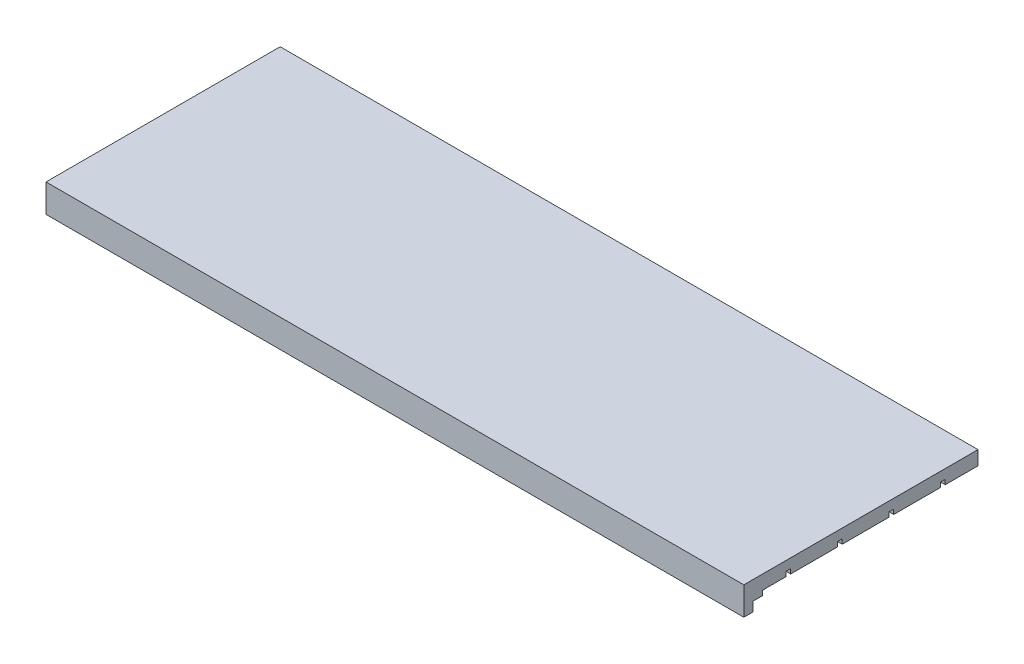
ISO-10303-21;
HEADER;
FILE_DESCRIPTION(('STEP AP214'),'2;1');
FILE_NAME('part.step','',(''),(''),'','','');
FILE_SCHEMA(('AUTOMOTIVE_DESIGN { 1 0 10303 214 1 1 1 1 }'));
ENDSEC;
DATA;
#1=APPLICATION_CONTEXT('core data for automotive mechanical design processes');
#2=APPLICATION_PROTOCOL_DEFINITION('international standard','automotive_design',2000,#1);
#3=PRODUCT_CONTEXT('',#1,'mechanical');
#4=PRODUCT('Part','Part','',(#3));
#5=PRODUCT_RELATED_PRODUCT_CATEGORY('part','',(#4));
#6=PRODUCT_DEFINITION_FORMATION('','',#4);
#7=PRODUCT_DEFINITION_CONTEXT('part definition',#1,'design');
#8=PRODUCT_DEFINITION('design','',#6,#7);
#9=PRODUCT_DEFINITION_SHAPE('','',#8);
#10=(LENGTH_UNIT() NAMED_UNIT(*) SI_UNIT(.MILLI.,.METRE.));
#11=(NAMED_UNIT(*) PLANE_ANGLE_UNIT() SI_UNIT($,.RADIAN.));
#12=(NAMED_UNIT(*) SI_UNIT($,.STERADIAN.) SOLID_ANGLE_UNIT());
#13=UNCERTAINTY_MEASURE_WITH_UNIT(LENGTH_MEASURE(1.E-05),#10,'distance_accuracy_value','');
#14=(GEOMETRIC_REPRESENTATION_CONTEXT(3) GLOBAL_UNCERTAINTY_ASSIGNED_CONTEXT((#13)) GLOBAL_UNIT_ASSIGNED_CONTEXT((#10,
#11,#12)) REPRESENTATION_CONTEXT('',''));
#15=CARTESIAN_POINT('',(0.,0.,0.));
#16=DIRECTION('',(0.,0.,1.));
#17=DIRECTION('',(1.,0.,0.));
#18=AXIS2_PLACEMENT_3D('',#15,#16,#17);
#19=CARTESIAN_POINT('',(0.,0.,0.));
#20=DIRECTION('',(0.,1.,0.));
#21=DIRECTION('',(0.,0.,1.));
#22=AXIS2_PLACEMENT_3D('',#19,#20,#21);
#23=PLANE('',#22);
#24=DIRECTION('',(1.,0.,0.));
#25=VECTOR('',#24,1.);
#26=CARTESIAN_POINT('',(-74.5,0.,21.));
#27=LINE('',#26,#25);
#28=CARTESIAN_POINT('',(-74.5,0.,21.));
#29=VERTEX_POINT('',#28);
#30=CARTESIAN_POINT('',(74.5,0.,21.));
#31=VERTEX_POINT('',#30);
#32=EDGE_CURVE('E223',#29,#31,#27,.T.);
#33=ORIENTED_EDGE('',*,*,#32,.F.);
#34=DIRECTION('',(0.,0.,1.));
#35=VECTOR('',#34,1.);
#36=CARTESIAN_POINT('',(-74.5,0.,-25.));
#37=LINE('',#36,#35);
#38=CARTESIAN_POINT('',(-74.5,0.,16.));
#39=VERTEX_POINT('',#38);
#40=EDGE_CURVE('E356',#39,#29,#37,.T.);
#41=ORIENTED_EDGE('',*,*,#40,.F.);
#42=DIRECTION('',(-1.,0.,0.));
#43=VECTOR('',#42,1.);
#44=CARTESIAN_POINT('',(-74.5,0.,16.));
#45=LINE('',#44,#43);
#46=CARTESIAN_POINT('',(74.5,0.,16.));
#47=VERTEX_POINT('',#46);
#48=EDGE_CURVE('E321',#47,#39,#45,.T.);
#49=ORIENTED_EDGE('',*,*,#48,.F.);
#50=DIRECTION('',(0.,0.,-1.));
#51=VECTOR('',#50,1.);
#52=CARTESIAN_POINT('',(74.5,0.,-25.));
#53=LINE('',#52,#51);
#54=EDGE_CURVE('E351',#31,#47,#53,.T.);
#55=ORIENTED_EDGE('',*,*,#54,.F.);
#56=EDGE_LOOP('',(#33,#41,#49,#55));
#57=FACE_BOUND('',#56,.T.);
#58=ADVANCED_FACE('F37',(#57),#23,.F.);
#59=CARTESIAN_POINT('',(-74.5,0.,-17.));
#60=VERTEX_POINT('',#59);
#61=CARTESIAN_POINT('',(-74.5,0.,-7.));
#62=VERTEX_POINT('',#61);
#63=EDGE_CURVE('E359',#60,#62,#37,.T.);
#64=ORIENTED_EDGE('',*,*,#63,.F.);
#65=DIRECTION('',(-1.,0.,0.));
#66=VECTOR('',#65,1.);
#67=CARTESIAN_POINT('',(-74.5,0.,-17.));
#68=LINE('',#67,#66);
#69=CARTESIAN_POINT('',(74.5,0.,-17.));
#70=VERTEX_POINT('',#69);
#71=EDGE_CURVE('E244',#70,#60,#68,.T.);
#72=ORIENTED_EDGE('',*,*,#71,.F.);
#73=CARTESIAN_POINT('',(74.5,0.,-7.));
#74=VERTEX_POINT('',#73);
#75=EDGE_CURVE('E674',#74,#70,#53,.T.);
#76=ORIENTED_EDGE('',*,*,#75,.F.);
#77=DIRECTION('',(1.,0.,0.));
#78=VECTOR('',#77,1.);
#79=CARTESIAN_POINT('',(-74.5,0.,-7.));
#80=LINE('',#79,#78);
#81=EDGE_CURVE('E280',#62,#74,#80,.T.);
#82=ORIENTED_EDGE('',*,*,#81,.F.);
#83=EDGE_LOOP('',(#64,#72,#76,#82));
#84=FACE_BOUND('',#83,.T.);
#85=ADVANCED_FACE('F391',(#84),#23,.F.);
#86=CARTESIAN_POINT('',(-74.5,0.,-5.99999999999999));
#87=VERTEX_POINT('',#86);
#88=CARTESIAN_POINT('',(-74.5,0.,4.));
#89=VERTEX_POINT('',#88);
#90=EDGE_CURVE('E393',#87,#89,#37,.T.);
#91=ORIENTED_EDGE('',*,*,#90,.F.);
#92=DIRECTION('',(-1.,0.,0.));
#93=VECTOR('',#92,1.);
#94=CARTESIAN_POINT('',(-74.5,0.,-5.99999999999999));
#95=LINE('',#94,#93);
#96=CARTESIAN_POINT('',(74.5,0.,-6.));
#97=VERTEX_POINT('',#96);
#98=EDGE_CURVE('E271',#97,#87,#95,.T.);
#99=ORIENTED_EDGE('',*,*,#98,.F.);
#100=CARTESIAN_POINT('',(74.5,0.,4.));
#101=VERTEX_POINT('',#100);
#102=EDGE_CURVE('E676',#101,#97,#53,.T.);
#103=ORIENTED_EDGE('',*,*,#102,.F.);
#104=DIRECTION('',(1.,0.,0.));
#105=VECTOR('',#104,1.);
#106=CARTESIAN_POINT('',(-74.5,0.,4.));
#107=LINE('',#106,#105);
#108=EDGE_CURVE('E305',#89,#101,#107,.T.);
#109=ORIENTED_EDGE('',*,*,#108,.F.);
#110=EDGE_LOOP('',(#91,#99,#103,#109));
#111=FACE_BOUND('',#110,.T.);
#112=ADVANCED_FACE('F436',(#111),#23,.F.);
#113=CARTESIAN_POINT('',(-74.5,0.,5.));
#114=VERTEX_POINT('',#113);
#115=CARTESIAN_POINT('',(-74.5,0.,15.));
#116=VERTEX_POINT('',#115);
#117=EDGE_CURVE('E395',#114,#116,#37,.T.);
#118=ORIENTED_EDGE('',*,*,#117,.F.);
#119=DIRECTION('',(-1.,0.,0.));
#120=VECTOR('',#119,1.);
#121=CARTESIAN_POINT('',(-74.5,0.,5.));
#122=LINE('',#121,#120);
#123=CARTESIAN_POINT('',(74.5,0.,5.));
#124=VERTEX_POINT('',#123);
#125=EDGE_CURVE('E296',#124,#114,#122,.T.);
#126=ORIENTED_EDGE('',*,*,#125,.F.);
#127=CARTESIAN_POINT('',(74.5,0.,15.));
#128=VERTEX_POINT('',#127);
#129=EDGE_CURVE('E354',#128,#124,#53,.T.);
#130=ORIENTED_EDGE('',*,*,#129,.F.);
#131=DIRECTION('',(1.,0.,0.));
#132=VECTOR('',#131,1.);
#133=CARTESIAN_POINT('',(-74.5,0.,15.));
#134=LINE('',#133,#132);
#135=EDGE_CURVE('E239',#116,#128,#134,.T.);
#136=ORIENTED_EDGE('',*,*,#135,.F.);
#137=EDGE_LOOP('',(#118,#126,#130,#136));
#138=FACE_BOUND('',#137,.T.);
#139=ADVANCED_FACE('F430',(#138),#23,.F.);
#140=CARTESIAN_POINT('',(74.5,3.,-25.));
#141=DIRECTION('',(-1.,0.,0.));
#142=DIRECTION('',(0.,0.,1.));
#143=AXIS2_PLACEMENT_3D('',#140,#141,#142);
#144=PLANE('',#143);
#145=ORIENTED_EDGE('',*,*,#75,.T.);
#146=DIRECTION('',(0.,-1.,0.));
#147=VECTOR('',#146,1.);
#148=CARTESIAN_POINT('',(74.5,1.,-17.));
#149=LINE('',#148,#147);
#150=CARTESIAN_POINT('',(74.5,1.,-17.));
#151=VERTEX_POINT('',#150);
#152=EDGE_CURVE('E261',#151,#70,#149,.T.);
#153=ORIENTED_EDGE('',*,*,#152,.F.);
#154=DIRECTION('',(0.,0.,1.));
#155=VECTOR('',#154,1.);
#156=CARTESIAN_POINT('',(74.5,1.,-17.));
#157=LINE('',#156,#155);
#158=CARTESIAN_POINT('',(74.5000000000001,1.,-18.));
#159=VERTEX_POINT('',#158);
#160=EDGE_CURVE('E247',#159,#151,#157,.T.);
#161=ORIENTED_EDGE('',*,*,#160,.F.);
#162=DIRECTION('',(0.,-1.,0.));
#163=VECTOR('',#162,1.);
#164=CARTESIAN_POINT('',(74.5000000000001,1.,-18.));
#165=LINE('',#164,#163);
#166=CARTESIAN_POINT('',(74.5000000000001,0.,-18.));
#167=VERTEX_POINT('',#166);
#168=EDGE_CURVE('E263',#159,#167,#165,.T.);
#169=ORIENTED_EDGE('',*,*,#168,.T.);
#170=CARTESIAN_POINT('',(74.5,0.,-25.));
#171=VERTEX_POINT('',#170);
#172=EDGE_CURVE('E260',#167,#171,#53,.T.);
#173=ORIENTED_EDGE('',*,*,#172,.T.);
#174=DIRECTION('',(0.,-1.,0.));
#175=VECTOR('',#174,1.);
#176=CARTESIAN_POINT('',(74.5,3.,-25.));
#177=LINE('',#176,#175);
#178=CARTESIAN_POINT('',(74.5,3.,-25.));
#179=VERTEX_POINT('',#178);
#180=EDGE_CURVE('E11',#179,#171,#177,.T.);
#181=ORIENTED_EDGE('',*,*,#180,.F.);
#182=DIRECTION('',(0.,0.,-1.));
#183=VECTOR('',#182,1.);
#184=CARTESIAN_POINT('',(74.5,3.,-25.));
#185=LINE('',#184,#183);
#186=CARTESIAN_POINT('',(74.5,3.,25.));
#187=VERTEX_POINT('',#186);
#188=EDGE_CURVE('E340',#187,#179,#185,.T.);
#189=ORIENTED_EDGE('',*,*,#188,.F.);
#190=DIRECTION('',(0.,-1.,0.));
#191=VECTOR('',#190,1.);
#192=CARTESIAN_POINT('',(74.5,3.,25.));
#193=LINE('',#192,#191);
#194=CARTESIAN_POINT('',(74.5,-3.,25.));
#195=VERTEX_POINT('',#194);
#196=EDGE_CURVE('E350',#187,#195,#193,.T.);
#197=ORIENTED_EDGE('',*,*,#196,.T.);
#198=DIRECTION('',(0.,0.,1.));
#199=VECTOR('',#198,1.);
#200=CARTESIAN_POINT('',(74.5,-3.,25.));
#201=LINE('',#200,#199);
#202=CARTESIAN_POINT('',(74.5,-3.,23.));
#203=VERTEX_POINT('',#202);
#204=EDGE_CURVE('E208',#203,#195,#201,.T.);
#205=ORIENTED_EDGE('',*,*,#204,.F.);
#206=DIRECTION('',(0.,1.,0.));
#207=VECTOR('',#206,1.);
#208=CARTESIAN_POINT('',(74.5,-3.,23.));
#209=LINE('',#208,#207);
#210=CARTESIAN_POINT('',(74.5,-1.,23.));
#211=VERTEX_POINT('',#210);
#212=EDGE_CURVE('E204',#203,#211,#209,.T.);
#213=ORIENTED_EDGE('',*,*,#212,.T.);
#214=DIRECTION('',(0.,0.,1.));
#215=VECTOR('',#214,1.);
#216=CARTESIAN_POINT('',(74.5,-1.,25.));
#217=LINE('',#216,#215);
#218=CARTESIAN_POINT('',(74.5,-1.,21.));
#219=VERTEX_POINT('',#218);
#220=EDGE_CURVE('E232',#219,#211,#217,.T.);
#221=ORIENTED_EDGE('',*,*,#220,.F.);
#222=DIRECTION('',(0.,1.,0.));
#223=VECTOR('',#222,1.);
#224=CARTESIAN_POINT('',(74.5,-1.,21.));
#225=LINE('',#224,#223);
#226=EDGE_CURVE('E233',#219,#31,#225,.T.);
#227=ORIENTED_EDGE('',*,*,#226,.T.);
#228=ORIENTED_EDGE('',*,*,#54,.T.);
#229=DIRECTION('',(0.,-1.,0.));
#230=VECTOR('',#229,1.);
#231=CARTESIAN_POINT('',(74.5,1.,16.));
#232=LINE('',#231,#230);
#233=CARTESIAN_POINT('',(74.5,1.,16.));
#234=VERTEX_POINT('',#233);
#235=EDGE_CURVE('E333',#234,#47,#232,.T.);
#236=ORIENTED_EDGE('',*,*,#235,.F.);
#237=DIRECTION('',(0.,0.,1.));
#238=VECTOR('',#237,1.);
#239=CARTESIAN_POINT('',(74.5,1.,16.));
#240=LINE('',#239,#238);
#241=CARTESIAN_POINT('',(74.5,1.,15.));
#242=VERTEX_POINT('',#241);
#243=EDGE_CURVE('E324',#242,#234,#240,.T.);
#244=ORIENTED_EDGE('',*,*,#243,.F.);
#245=DIRECTION('',(0.,-1.,0.));
#246=VECTOR('',#245,1.);
#247=CARTESIAN_POINT('',(74.5,1.,15.));
#248=LINE('',#247,#246);
#249=EDGE_CURVE('E336',#242,#128,#248,.T.);
#250=ORIENTED_EDGE('',*,*,#249,.T.);
#251=ORIENTED_EDGE('',*,*,#129,.T.);
#252=DIRECTION('',(0.,-1.,0.));
#253=VECTOR('',#252,1.);
#254=CARTESIAN_POINT('',(74.5,1.,5.));
#255=LINE('',#254,#253);
#256=CARTESIAN_POINT('',(74.5,1.,5.));
#257=VERTEX_POINT('',#256);
#258=EDGE_CURVE('E311',#257,#124,#255,.T.);
#259=ORIENTED_EDGE('',*,*,#258,.F.);
#260=DIRECTION('',(0.,0.,1.));
#261=VECTOR('',#260,1.);
#262=CARTESIAN_POINT('',(74.5,1.,5.));
#263=LINE('',#262,#261);
#264=CARTESIAN_POINT('',(74.5,1.,4.));
#265=VERTEX_POINT('',#264);
#266=EDGE_CURVE('E299',#265,#257,#263,.T.);
#267=ORIENTED_EDGE('',*,*,#266,.F.);
#268=DIRECTION('',(0.,-1.,0.));
#269=VECTOR('',#268,1.);
#270=CARTESIAN_POINT('',(74.5,1.,4.));
#271=LINE('',#270,#269);
#272=EDGE_CURVE('E313',#265,#101,#271,.T.);
#273=ORIENTED_EDGE('',*,*,#272,.T.);
#274=ORIENTED_EDGE('',*,*,#102,.T.);
#275=DIRECTION('',(0.,-1.,0.));
#276=VECTOR('',#275,1.);
#277=CARTESIAN_POINT('',(74.5,1.,-6.));
#278=LINE('',#277,#276);
#279=CARTESIAN_POINT('',(74.5,1.,-6.));
#280=VERTEX_POINT('',#279);
#281=EDGE_CURVE('E286',#280,#97,#278,.T.);
#282=ORIENTED_EDGE('',*,*,#281,.F.);
#283=DIRECTION('',(0.,0.,1.));
#284=VECTOR('',#283,1.);
#285=CARTESIAN_POINT('',(74.5,1.,-6.));
#286=LINE('',#285,#284);
#287=CARTESIAN_POINT('',(74.5,1.,-7.));
#288=VERTEX_POINT('',#287);
#289=EDGE_CURVE('E274',#288,#280,#286,.T.);
#290=ORIENTED_EDGE('',*,*,#289,.F.);
#291=DIRECTION('',(0.,-1.,0.));
#292=VECTOR('',#291,1.);
#293=CARTESIAN_POINT('',(74.5,1.,-7.));
#294=LINE('',#293,#292);
#295=EDGE_CURVE('E288',#288,#74,#294,.T.);
#296=ORIENTED_EDGE('',*,*,#295,.T.);
#297=EDGE_LOOP('',(#145,#153,#161,#169,#173,#181,#189,#197,#205,#213,#221,#227,#228,#236,#244,
#250,#251,#259,#267,#273,#274,#282,#290,#296));
#298=FACE_BOUND('',#297,.T.);
#299=ADVANCED_FACE('F39',(#298),#144,.F.);
#300=CARTESIAN_POINT('',(-74.5,3.,-25.));
#301=DIRECTION('',(0.,0.,1.));
#302=DIRECTION('',(1.,0.,0.));
#303=AXIS2_PLACEMENT_3D('',#300,#301,#302);
#304=PLANE('',#303);
#305=DIRECTION('',(-1.,0.,0.));
#306=VECTOR('',#305,1.);
#307=CARTESIAN_POINT('',(-74.5,0.,-25.));
#308=LINE('',#307,#306);
#309=CARTESIAN_POINT('',(-74.5,0.,-25.));
#310=VERTEX_POINT('',#309);
#311=EDGE_CURVE('E353',#171,#310,#308,.T.);
#312=ORIENTED_EDGE('',*,*,#311,.T.);
#313=DIRECTION('',(0.,-1.,0.));
#314=VECTOR('',#313,1.);
#315=CARTESIAN_POINT('',(-74.5,3.,-25.));
#316=LINE('',#315,#314);
#317=CARTESIAN_POINT('',(-74.5,3.,-25.));
#318=VERTEX_POINT('',#317);
#319=EDGE_CURVE('E45',#318,#310,#316,.T.);
#320=ORIENTED_EDGE('',*,*,#319,.F.);
#321=DIRECTION('',(-1.,0.,0.));
#322=VECTOR('',#321,1.);
#323=CARTESIAN_POINT('',(-74.5,3.,-25.));
#324=LINE('',#323,#322);
#325=EDGE_CURVE('E343',#179,#318,#324,.T.);
#326=ORIENTED_EDGE('',*,*,#325,.F.);
#327=ORIENTED_EDGE('',*,*,#180,.T.);
#328=EDGE_LOOP('',(#312,#320,#326,#327));
#329=FACE_BOUND('',#328,.T.);
#330=ADVANCED_FACE('F423',(#329),#304,.F.);
#331=CARTESIAN_POINT('',(-74.5,3.,-25.));
#332=DIRECTION('',(1.,0.,0.));
#333=DIRECTION('',(0.,0.,-1.));
#334=AXIS2_PLACEMENT_3D('',#331,#332,#333);
#335=PLANE('',#334);
#336=DIRECTION('',(0.,0.,-1.));
#337=VECTOR('',#336,1.);
#338=CARTESIAN_POINT('',(-74.5,1.,-17.));
#339=LINE('',#338,#337);
#340=CARTESIAN_POINT('',(-74.5,1.,-17.));
#341=VERTEX_POINT('',#340);
#342=CARTESIAN_POINT('',(-74.5,1.,-18.));
#343=VERTEX_POINT('',#342);
#344=EDGE_CURVE('E240',#341,#343,#339,.T.);
#345=ORIENTED_EDGE('',*,*,#344,.F.);
#346=DIRECTION('',(0.,-1.,0.));
#347=VECTOR('',#346,1.);
#348=CARTESIAN_POINT('',(-74.5,1.,-17.));
#349=LINE('',#348,#347);
#350=EDGE_CURVE('E257',#341,#60,#349,.T.);
#351=ORIENTED_EDGE('',*,*,#350,.T.);
#352=ORIENTED_EDGE('',*,*,#63,.T.);
#353=DIRECTION('',(0.,-1.,0.));
#354=VECTOR('',#353,1.);
#355=CARTESIAN_POINT('',(-74.5,1.,-7.));
#356=LINE('',#355,#354);
#357=CARTESIAN_POINT('',(-74.5,1.,-7.));
#358=VERTEX_POINT('',#357);
#359=EDGE_CURVE('E279',#358,#62,#356,.T.);
#360=ORIENTED_EDGE('',*,*,#359,.F.);
#361=DIRECTION('',(0.,0.,-1.));
#362=VECTOR('',#361,1.);
#363=CARTESIAN_POINT('',(-74.5,1.,-5.99999999999999));
#364=LINE('',#363,#362);
#365=CARTESIAN_POINT('',(-74.5,1.,-5.99999999999999));
#366=VERTEX_POINT('',#365);
#367=EDGE_CURVE('E267',#366,#358,#364,.T.);
#368=ORIENTED_EDGE('',*,*,#367,.F.);
#369=DIRECTION('',(0.,-1.,0.));
#370=VECTOR('',#369,1.);
#371=CARTESIAN_POINT('',(-74.5,1.,-5.99999999999999));
#372=LINE('',#371,#370);
#373=EDGE_CURVE('E255',#366,#87,#372,.T.);
#374=ORIENTED_EDGE('',*,*,#373,.T.);
#375=ORIENTED_EDGE('',*,*,#90,.T.);
#376=DIRECTION('',(0.,-1.,0.));
#377=VECTOR('',#376,1.);
#378=CARTESIAN_POINT('',(-74.5,1.,4.));
#379=LINE('',#378,#377);
#380=CARTESIAN_POINT('',(-74.5,1.,4.));
#381=VERTEX_POINT('',#380);
#382=EDGE_CURVE('E304',#381,#89,#379,.T.);
#383=ORIENTED_EDGE('',*,*,#382,.F.);
#384=DIRECTION('',(0.,0.,-1.));
#385=VECTOR('',#384,1.);
#386=CARTESIAN_POINT('',(-74.5,1.,5.));
#387=LINE('',#386,#385);
#388=CARTESIAN_POINT('',(-74.5,1.,5.));
#389=VERTEX_POINT('',#388);
#390=EDGE_CURVE('E292',#389,#381,#387,.T.);
#391=ORIENTED_EDGE('',*,*,#390,.F.);
#392=DIRECTION('',(0.,-1.,0.));
#393=VECTOR('',#392,1.);
#394=CARTESIAN_POINT('',(-74.5,1.,5.));
#395=LINE('',#394,#393);
#396=EDGE_CURVE('E282',#389,#114,#395,.T.);
#397=ORIENTED_EDGE('',*,*,#396,.T.);
#398=ORIENTED_EDGE('',*,*,#117,.T.);
#399=DIRECTION('',(0.,-1.,0.));
#400=VECTOR('',#399,1.);
#401=CARTESIAN_POINT('',(-74.5,1.,15.));
#402=LINE('',#401,#400);
#403=CARTESIAN_POINT('',(-74.5,1.,15.));
#404=VERTEX_POINT('',#403);
#405=EDGE_CURVE('E60',#404,#116,#402,.T.);
#406=ORIENTED_EDGE('',*,*,#405,.F.);
#407=DIRECTION('',(0.,0.,-1.));
#408=VECTOR('',#407,1.);
#409=CARTESIAN_POINT('',(-74.5,1.,16.));
#410=LINE('',#409,#408);
#411=CARTESIAN_POINT('',(-74.5,1.,16.));
#412=VERTEX_POINT('',#411);
#413=EDGE_CURVE('E317',#412,#404,#410,.T.);
#414=ORIENTED_EDGE('',*,*,#413,.F.);
#415=DIRECTION('',(0.,-1.,0.));
#416=VECTOR('',#415,1.);
#417=CARTESIAN_POINT('',(-74.5,1.,16.));
#418=LINE('',#417,#416);
#419=EDGE_CURVE('E307',#412,#39,#418,.T.);
#420=ORIENTED_EDGE('',*,*,#419,.T.);
#421=ORIENTED_EDGE('',*,*,#40,.T.);
#422=DIRECTION('',(0.,1.,0.));
#423=VECTOR('',#422,1.);
#424=CARTESIAN_POINT('',(-74.5,-1.,21.));
#425=LINE('',#424,#423);
#426=CARTESIAN_POINT('',(-74.5,-1.,21.));
#427=VERTEX_POINT('',#426);
#428=EDGE_CURVE('E237',#427,#29,#425,.T.);
#429=ORIENTED_EDGE('',*,*,#428,.F.);
#430=DIRECTION('',(0.,0.,-1.));
#431=VECTOR('',#430,1.);
#432=CARTESIAN_POINT('',(-74.5,-1.,25.));
#433=LINE('',#432,#431);
#434=CARTESIAN_POINT('',(-74.5,-1.,23.));
#435=VERTEX_POINT('',#434);
#436=EDGE_CURVE('E222',#435,#427,#433,.T.);
#437=ORIENTED_EDGE('',*,*,#436,.F.);
#438=DIRECTION('',(0.,1.,0.));
#439=VECTOR('',#438,1.);
#440=CARTESIAN_POINT('',(-74.5,-3.,23.));
#441=LINE('',#440,#439);
#442=CARTESIAN_POINT('',(-74.5,-3.,23.));
#443=VERTEX_POINT('',#442);
#444=EDGE_CURVE('E202',#443,#435,#441,.T.);
#445=ORIENTED_EDGE('',*,*,#444,.F.);
#446=DIRECTION('',(0.,0.,-1.));
#447=VECTOR('',#446,1.);
#448=CARTESIAN_POINT('',(-74.5,-3.,25.));
#449=LINE('',#448,#447);
#450=CARTESIAN_POINT('',(-74.5,-3.,25.));
#451=VERTEX_POINT('',#450);
#452=EDGE_CURVE('E209',#451,#443,#449,.T.);
#453=ORIENTED_EDGE('',*,*,#452,.F.);
#454=DIRECTION('',(0.,-1.,0.));
#455=VECTOR('',#454,1.);
#456=CARTESIAN_POINT('',(-74.5,3.,25.));
#457=LINE('',#456,#455);
#458=CARTESIAN_POINT('',(-74.5,3.,25.));
#459=VERTEX_POINT('',#458);
#460=EDGE_CURVE('E361',#459,#451,#457,.T.);
#461=ORIENTED_EDGE('',*,*,#460,.F.);
#462=DIRECTION('',(0.,0.,1.));
#463=VECTOR('',#462,1.);
#464=CARTESIAN_POINT('',(-74.5,3.,-25.));
#465=LINE('',#464,#463);
#466=EDGE_CURVE('E346',#318,#459,#465,.T.);
#467=ORIENTED_EDGE('',*,*,#466,.F.);
#468=ORIENTED_EDGE('',*,*,#319,.T.);
#469=CARTESIAN_POINT('',(-74.5,0.,-18.));
#470=VERTEX_POINT('',#469);
#471=EDGE_CURVE('E344',#310,#470,#37,.T.);
#472=ORIENTED_EDGE('',*,*,#471,.T.);
#473=DIRECTION('',(0.,-1.,0.));
#474=VECTOR('',#473,1.);
#475=CARTESIAN_POINT('',(-74.5,1.,-18.));
#476=LINE('',#475,#474);
#477=EDGE_CURVE('E252',#343,#470,#476,.T.);
#478=ORIENTED_EDGE('',*,*,#477,.F.);
#479=EDGE_LOOP('',(#345,#351,#352,#360,#368,#374,#375,#383,#391,#397,#398,#406,#414,#420,#421,
#429,#437,#445,#453,#461,#467,#468,#472,#478));
#480=FACE_BOUND('',#479,.T.);
#481=ADVANCED_FACE('F220',(#480),#335,.F.);
#482=CARTESIAN_POINT('',(-74.5,3.,25.));
#483=DIRECTION('',(0.,0.,-1.));
#484=DIRECTION('',(-1.,0.,0.));
#485=AXIS2_PLACEMENT_3D('',#482,#483,#484);
#486=PLANE('',#485);
#487=ORIENTED_EDGE('',*,*,#460,.T.);
#488=DIRECTION('',(-1.,0.,0.));
#489=VECTOR('',#488,1.);
#490=CARTESIAN_POINT('',(-74.5,-3.,25.));
#491=LINE('',#490,#489);
#492=EDGE_CURVE('E215',#195,#451,#491,.T.);
#493=ORIENTED_EDGE('',*,*,#492,.F.);
#494=ORIENTED_EDGE('',*,*,#196,.F.);
#495=DIRECTION('',(1.,0.,0.));
#496=VECTOR('',#495,1.);
#497=CARTESIAN_POINT('',(-74.5,3.,25.));
#498=LINE('',#497,#496);
#499=EDGE_CURVE('E348',#459,#187,#498,.T.);
#500=ORIENTED_EDGE('',*,*,#499,.F.);
#501=EDGE_LOOP('',(#487,#493,#494,#500));
#502=FACE_BOUND('',#501,.T.);
#503=ADVANCED_FACE('F418',(#502),#486,.F.);
#504=CARTESIAN_POINT('',(0.,3.,0.));
#505=DIRECTION('',(0.,1.,0.));
#506=DIRECTION('',(0.,0.,1.));
#507=AXIS2_PLACEMENT_3D('',#504,#505,#506);
#508=PLANE('',#507);
#509=ORIENTED_EDGE('',*,*,#188,.T.);
#510=ORIENTED_EDGE('',*,*,#325,.T.);
#511=ORIENTED_EDGE('',*,*,#466,.T.);
#512=ORIENTED_EDGE('',*,*,#499,.T.);
#513=EDGE_LOOP('',(#509,#510,#511,#512));
#514=FACE_BOUND('',#513,.T.);
#515=ADVANCED_FACE('F422',(#514),#508,.T.);
#516=ORIENTED_EDGE('',*,*,#172,.F.);
#517=DIRECTION('',(1.,0.,0.));
#518=VECTOR('',#517,1.);
#519=CARTESIAN_POINT('',(-74.5,0.,-18.));
#520=LINE('',#519,#518);
#521=EDGE_CURVE('E253',#470,#167,#520,.T.);
#522=ORIENTED_EDGE('',*,*,#521,.F.);
#523=ORIENTED_EDGE('',*,*,#471,.F.);
#524=ORIENTED_EDGE('',*,*,#311,.F.);
#525=EDGE_LOOP('',(#516,#522,#523,#524));
#526=FACE_BOUND('',#525,.T.);
#527=ADVANCED_FACE('F372',(#526),#23,.F.);
#528=CARTESIAN_POINT('',(-74.5,1.,16.));
#529=DIRECTION('',(0.,0.,1.));
#530=DIRECTION('',(1.,0.,0.));
#531=AXIS2_PLACEMENT_3D('',#528,#529,#530);
#532=PLANE('',#531);
#533=ORIENTED_EDGE('',*,*,#48,.T.);
#534=ORIENTED_EDGE('',*,*,#419,.F.);
#535=DIRECTION('',(-1.,0.,0.));
#536=VECTOR('',#535,1.);
#537=CARTESIAN_POINT('',(-74.5,1.,16.));
#538=LINE('',#537,#536);
#539=EDGE_CURVE('E326',#234,#412,#538,.T.);
#540=ORIENTED_EDGE('',*,*,#539,.F.);
#541=ORIENTED_EDGE('',*,*,#235,.T.);
#542=EDGE_LOOP('',(#533,#534,#540,#541));
#543=FACE_BOUND('',#542,.T.);
#544=ADVANCED_FACE('F440',(#543),#532,.F.);
#545=CARTESIAN_POINT('',(-74.5,1.,15.));
#546=DIRECTION('',(0.,0.,-1.));
#547=DIRECTION('',(-1.,0.,0.));
#548=AXIS2_PLACEMENT_3D('',#545,#546,#547);
#549=PLANE('',#548);
#550=ORIENTED_EDGE('',*,*,#135,.T.);
#551=ORIENTED_EDGE('',*,*,#249,.F.);
#552=DIRECTION('',(1.,0.,0.));
#553=VECTOR('',#552,1.);
#554=CARTESIAN_POINT('',(-74.5,1.,15.));
#555=LINE('',#554,#553);
#556=EDGE_CURVE('E320',#404,#242,#555,.T.);
#557=ORIENTED_EDGE('',*,*,#556,.F.);
#558=ORIENTED_EDGE('',*,*,#405,.T.);
#559=EDGE_LOOP('',(#550,#551,#557,#558));
#560=FACE_BOUND('',#559,.T.);
#561=ADVANCED_FACE('F445',(#560),#549,.F.);
#562=CARTESIAN_POINT('',(0.,1.,0.));
#563=DIRECTION('',(0.,-1.,0.));
#564=DIRECTION('',(0.,0.,-1.));
#565=AXIS2_PLACEMENT_3D('',#562,#563,#564);
#566=PLANE('',#565);
#567=ORIENTED_EDGE('',*,*,#413,.T.);
#568=ORIENTED_EDGE('',*,*,#556,.T.);
#569=ORIENTED_EDGE('',*,*,#243,.T.);
#570=ORIENTED_EDGE('',*,*,#539,.T.);
#571=EDGE_LOOP('',(#567,#568,#569,#570));
#572=FACE_BOUND('',#571,.T.);
#573=ADVANCED_FACE('F461',(#572),#566,.T.);
#574=CARTESIAN_POINT('',(-74.5,1.,5.));
#575=DIRECTION('',(0.,0.,1.));
#576=DIRECTION('',(1.,0.,0.));
#577=AXIS2_PLACEMENT_3D('',#574,#575,#576);
#578=PLANE('',#577);
#579=ORIENTED_EDGE('',*,*,#125,.T.);
#580=ORIENTED_EDGE('',*,*,#396,.F.);
#581=DIRECTION('',(-1.,0.,0.));
#582=VECTOR('',#581,1.);
#583=CARTESIAN_POINT('',(-74.5,1.,5.));
#584=LINE('',#583,#582);
#585=EDGE_CURVE('E301',#257,#389,#584,.T.);
#586=ORIENTED_EDGE('',*,*,#585,.F.);
#587=ORIENTED_EDGE('',*,*,#258,.T.);
#588=EDGE_LOOP('',(#579,#580,#586,#587));
#589=FACE_BOUND('',#588,.T.);
#590=ADVANCED_FACE('F463',(#589),#578,.F.);
#591=CARTESIAN_POINT('',(-74.5,1.,4.));
#592=DIRECTION('',(0.,0.,-1.));
#593=DIRECTION('',(-1.,0.,0.));
#594=AXIS2_PLACEMENT_3D('',#591,#592,#593);
#595=PLANE('',#594);
#596=ORIENTED_EDGE('',*,*,#108,.T.);
#597=ORIENTED_EDGE('',*,*,#272,.F.);
#598=DIRECTION('',(1.,0.,0.));
#599=VECTOR('',#598,1.);
#600=CARTESIAN_POINT('',(-74.5,1.,4.));
#601=LINE('',#600,#599);
#602=EDGE_CURVE('E295',#381,#265,#601,.T.);
#603=ORIENTED_EDGE('',*,*,#602,.F.);
#604=ORIENTED_EDGE('',*,*,#382,.T.);
#605=EDGE_LOOP('',(#596,#597,#603,#604));
#606=FACE_BOUND('',#605,.T.);
#607=ADVANCED_FACE('F469',(#606),#595,.F.);
#608=CARTESIAN_POINT('',(0.,1.,0.));
#609=DIRECTION('',(0.,-1.,0.));
#610=DIRECTION('',(0.,0.,-1.));
#611=AXIS2_PLACEMENT_3D('',#608,#609,#610);
#612=PLANE('',#611);
#613=ORIENTED_EDGE('',*,*,#390,.T.);
#614=ORIENTED_EDGE('',*,*,#602,.T.);
#615=ORIENTED_EDGE('',*,*,#266,.T.);
#616=ORIENTED_EDGE('',*,*,#585,.T.);
#617=EDGE_LOOP('',(#613,#614,#615,#616));
#618=FACE_BOUND('',#617,.T.);
#619=ADVANCED_FACE('F475',(#618),#612,.T.);
#620=CARTESIAN_POINT('',(-74.5,1.,-5.99999999999999));
#621=DIRECTION('',(0.,0.,1.));
#622=DIRECTION('',(1.,0.,0.));
#623=AXIS2_PLACEMENT_3D('',#620,#621,#622);
#624=PLANE('',#623);
#625=ORIENTED_EDGE('',*,*,#98,.T.);
#626=ORIENTED_EDGE('',*,*,#373,.F.);
#627=DIRECTION('',(-1.,0.,0.));
#628=VECTOR('',#627,1.);
#629=CARTESIAN_POINT('',(-74.5,1.,-5.99999999999999));
#630=LINE('',#629,#628);
#631=EDGE_CURVE('E276',#280,#366,#630,.T.);
#632=ORIENTED_EDGE('',*,*,#631,.F.);
#633=ORIENTED_EDGE('',*,*,#281,.T.);
#634=EDGE_LOOP('',(#625,#626,#632,#633));
#635=FACE_BOUND('',#634,.T.);
#636=ADVANCED_FACE('F480',(#635),#624,.F.);
#637=CARTESIAN_POINT('',(-74.5,1.,-7.));
#638=DIRECTION('',(0.,0.,-1.));
#639=DIRECTION('',(-1.,0.,0.));
#640=AXIS2_PLACEMENT_3D('',#637,#638,#639);
#641=PLANE('',#640);
#642=ORIENTED_EDGE('',*,*,#81,.T.);
#643=ORIENTED_EDGE('',*,*,#295,.F.);
#644=DIRECTION('',(1.,0.,0.));
#645=VECTOR('',#644,1.);
#646=CARTESIAN_POINT('',(-74.5,1.,-7.));
#647=LINE('',#646,#645);
#648=EDGE_CURVE('E270',#358,#288,#647,.T.);
#649=ORIENTED_EDGE('',*,*,#648,.F.);
#650=ORIENTED_EDGE('',*,*,#359,.T.);
#651=EDGE_LOOP('',(#642,#643,#649,#650));
#652=FACE_BOUND('',#651,.T.);
#653=ADVANCED_FACE('F482',(#652),#641,.F.);
#654=CARTESIAN_POINT('',(0.,1.,0.));
#655=DIRECTION('',(0.,-1.,0.));
#656=DIRECTION('',(0.,0.,-1.));
#657=AXIS2_PLACEMENT_3D('',#654,#655,#656);
#658=PLANE('',#657);
#659=ORIENTED_EDGE('',*,*,#367,.T.);
#660=ORIENTED_EDGE('',*,*,#648,.T.);
#661=ORIENTED_EDGE('',*,*,#289,.T.);
#662=ORIENTED_EDGE('',*,*,#631,.T.);
#663=EDGE_LOOP('',(#659,#660,#661,#662));
#664=FACE_BOUND('',#663,.T.);
#665=ADVANCED_FACE('F485',(#664),#658,.T.);
#666=CARTESIAN_POINT('',(-74.5,1.,-17.));
#667=DIRECTION('',(0.,0.,1.));
#668=DIRECTION('',(1.,0.,0.));
#669=AXIS2_PLACEMENT_3D('',#666,#667,#668);
#670=PLANE('',#669);
#671=ORIENTED_EDGE('',*,*,#71,.T.);
#672=ORIENTED_EDGE('',*,*,#350,.F.);
#673=DIRECTION('',(-1.,0.,0.));
#674=VECTOR('',#673,1.);
#675=CARTESIAN_POINT('',(-74.5,1.,-17.));
#676=LINE('',#675,#674);
#677=EDGE_CURVE('E249',#151,#341,#676,.T.);
#678=ORIENTED_EDGE('',*,*,#677,.F.);
#679=ORIENTED_EDGE('',*,*,#152,.T.);
#680=EDGE_LOOP('',(#671,#672,#678,#679));
#681=FACE_BOUND('',#680,.T.);
#682=ADVANCED_FACE('F384',(#681),#670,.F.);
#683=CARTESIAN_POINT('',(-74.5,1.,-18.));
#684=DIRECTION('',(0.,0.,-1.));
#685=DIRECTION('',(-1.,0.,0.));
#686=AXIS2_PLACEMENT_3D('',#683,#684,#685);
#687=PLANE('',#686);
#688=ORIENTED_EDGE('',*,*,#521,.T.);
#689=ORIENTED_EDGE('',*,*,#168,.F.);
#690=DIRECTION('',(1.,0.,0.));
#691=VECTOR('',#690,1.);
#692=CARTESIAN_POINT('',(-74.5,1.,-18.));
#693=LINE('',#692,#691);
#694=EDGE_CURVE('E243',#343,#159,#693,.T.);
#695=ORIENTED_EDGE('',*,*,#694,.F.);
#696=ORIENTED_EDGE('',*,*,#477,.T.);
#697=EDGE_LOOP('',(#688,#689,#695,#696));
#698=FACE_BOUND('',#697,.T.);
#699=ADVANCED_FACE('F374',(#698),#687,.F.);
#700=CARTESIAN_POINT('',(0.,1.,0.));
#701=DIRECTION('',(0.,-1.,0.));
#702=DIRECTION('',(0.,0.,-1.));
#703=AXIS2_PLACEMENT_3D('',#700,#701,#702);
#704=PLANE('',#703);
#705=ORIENTED_EDGE('',*,*,#344,.T.);
#706=ORIENTED_EDGE('',*,*,#694,.T.);
#707=ORIENTED_EDGE('',*,*,#160,.T.);
#708=ORIENTED_EDGE('',*,*,#677,.T.);
#709=EDGE_LOOP('',(#705,#706,#707,#708));
#710=FACE_BOUND('',#709,.T.);
#711=ADVANCED_FACE('F382',(#710),#704,.T.);
#712=CARTESIAN_POINT('',(-74.5,-1.,21.));
#713=DIRECTION('',(0.,0.,1.));
#714=DIRECTION('',(1.,0.,0.));
#715=AXIS2_PLACEMENT_3D('',#712,#713,#714);
#716=PLANE('',#715);
#717=ORIENTED_EDGE('',*,*,#32,.T.);
#718=ORIENTED_EDGE('',*,*,#226,.F.);
#719=DIRECTION('',(1.,0.,0.));
#720=VECTOR('',#719,1.);
#721=CARTESIAN_POINT('',(-74.5,-1.,21.));
#722=LINE('',#721,#720);
#723=EDGE_CURVE('E230',#427,#219,#722,.T.);
#724=ORIENTED_EDGE('',*,*,#723,.F.);
#725=ORIENTED_EDGE('',*,*,#428,.T.);
#726=EDGE_LOOP('',(#717,#718,#724,#725));
#727=FACE_BOUND('',#726,.T.);
#728=ADVANCED_FACE('F409',(#727),#716,.F.);
#729=CARTESIAN_POINT('',(0.,-1.,0.));
#730=DIRECTION('',(0.,-1.,0.));
#731=DIRECTION('',(0.,0.,-1.));
#732=AXIS2_PLACEMENT_3D('',#729,#730,#731);
#733=PLANE('',#732);
#734=DIRECTION('',(1.,0.,0.));
#735=VECTOR('',#734,1.);
#736=CARTESIAN_POINT('',(-74.5,-1.,23.));
#737=LINE('',#736,#735);
#738=EDGE_CURVE('E52',#435,#211,#737,.T.);
#739=ORIENTED_EDGE('',*,*,#738,.F.);
#740=ORIENTED_EDGE('',*,*,#436,.T.);
#741=ORIENTED_EDGE('',*,*,#723,.T.);
#742=ORIENTED_EDGE('',*,*,#220,.T.);
#743=EDGE_LOOP('',(#739,#740,#741,#742));
#744=FACE_BOUND('',#743,.T.);
#745=ADVANCED_FACE('F413',(#744),#733,.T.);
#746=CARTESIAN_POINT('',(-74.5,-3.,23.));
#747=DIRECTION('',(0.,0.,1.));
#748=DIRECTION('',(1.,0.,0.));
#749=AXIS2_PLACEMENT_3D('',#746,#747,#748);
#750=PLANE('',#749);
#751=ORIENTED_EDGE('',*,*,#738,.T.);
#752=ORIENTED_EDGE('',*,*,#212,.F.);
#753=DIRECTION('',(1.,0.,0.));
#754=VECTOR('',#753,1.);
#755=CARTESIAN_POINT('',(-74.5,-3.,23.));
#756=LINE('',#755,#754);
#757=EDGE_CURVE('E198',#443,#203,#756,.T.);
#758=ORIENTED_EDGE('',*,*,#757,.F.);
#759=ORIENTED_EDGE('',*,*,#444,.T.);
#760=EDGE_LOOP('',(#751,#752,#758,#759));
#761=FACE_BOUND('',#760,.T.);
#762=ADVANCED_FACE('F200',(#761),#750,.F.);
#763=CARTESIAN_POINT('',(0.,-3.,0.));
#764=DIRECTION('',(0.,-1.,0.));
#765=DIRECTION('',(0.,0.,-1.));
#766=AXIS2_PLACEMENT_3D('',#763,#764,#765);
#767=PLANE('',#766);
#768=ORIENTED_EDGE('',*,*,#452,.T.);
#769=ORIENTED_EDGE('',*,*,#757,.T.);
#770=ORIENTED_EDGE('',*,*,#204,.T.);
#771=ORIENTED_EDGE('',*,*,#492,.T.);
#772=EDGE_LOOP('',(#768,#769,#770,#771));
#773=FACE_BOUND('',#772,.T.);
#774=ADVANCED_FACE('F213',(#773),#767,.T.);
#775=CLOSED_SHELL('',(#58,#85,#112,#139,#299,#330,#481,#503,#515,#527,#544,#561,#573,#590,#607,
#619,#636,#653,#665,#682,#699,#711,#728,#745,#762,#774));
#776=MANIFOLD_SOLID_BREP('B2',#775);
#777=ADVANCED_BREP_SHAPE_REPRESENTATION('',(#18,#776),#14);
#778=SHAPE_DEFINITION_REPRESENTATION(#9,#777);
ENDSEC;
END-ISO-10303-21;
